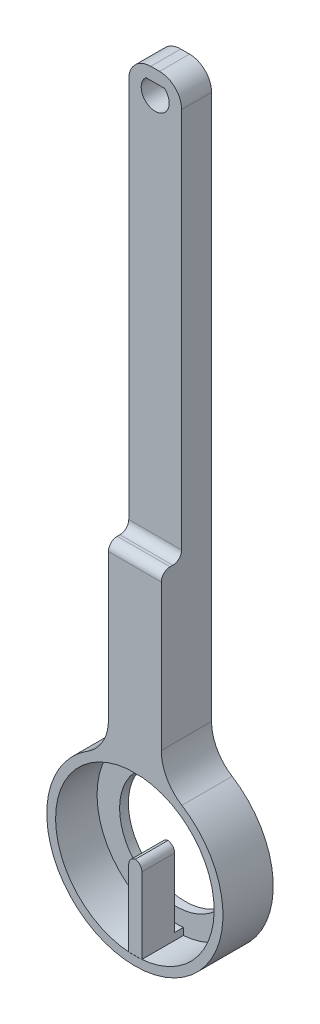
ISO-10303-21;
HEADER;
FILE_DESCRIPTION(('STEP AP214'),'2;1');
FILE_NAME('part.step','',(''),(''),'','','');
FILE_SCHEMA(('AUTOMOTIVE_DESIGN { 1 0 10303 214 1 1 1 1 }'));
ENDSEC;
DATA;
#1=APPLICATION_CONTEXT('core data for automotive mechanical design processes');
#2=APPLICATION_PROTOCOL_DEFINITION('international standard','automotive_design',2000,#1);
#3=PRODUCT_CONTEXT('',#1,'mechanical');
#4=PRODUCT('Part','Part','',(#3));
#5=PRODUCT_RELATED_PRODUCT_CATEGORY('part','',(#4));
#6=PRODUCT_DEFINITION_FORMATION('','',#4);
#7=PRODUCT_DEFINITION_CONTEXT('part definition',#1,'design');
#8=PRODUCT_DEFINITION('design','',#6,#7);
#9=PRODUCT_DEFINITION_SHAPE('','',#8);
#10=(LENGTH_UNIT() NAMED_UNIT(*) SI_UNIT(.MILLI.,.METRE.));
#11=(NAMED_UNIT(*) PLANE_ANGLE_UNIT() SI_UNIT($,.RADIAN.));
#12=(NAMED_UNIT(*) SI_UNIT($,.STERADIAN.) SOLID_ANGLE_UNIT());
#13=UNCERTAINTY_MEASURE_WITH_UNIT(LENGTH_MEASURE(1.E-05),#10,'distance_accuracy_value','');
#14=(GEOMETRIC_REPRESENTATION_CONTEXT(3) GLOBAL_UNCERTAINTY_ASSIGNED_CONTEXT((#13)) GLOBAL_UNIT_ASSIGNED_CONTEXT((#10,
#11,#12)) REPRESENTATION_CONTEXT('',''));
#15=CARTESIAN_POINT('',(0.,0.,0.));
#16=DIRECTION('',(0.,0.,1.));
#17=DIRECTION('',(1.,0.,0.));
#18=AXIS2_PLACEMENT_3D('',#15,#16,#17);
#19=CARTESIAN_POINT('',(0.359349427132485,-88.1961999037174,24.));
#20=DIRECTION('',(0.,0.,-1.));
#21=DIRECTION('',(-1.,0.,0.));
#22=AXIS2_PLACEMENT_3D('',#19,#20,#21);
#23=CYLINDRICAL_SURFACE('',#22,1.75);
#24=DIRECTION('',(0.,0.,-1.));
#25=VECTOR('',#24,1.);
#26=CARTESIAN_POINT('',(-1.39065057286751,-88.1961999037174,24.));
#27=LINE('',#26,#25);
#28=CARTESIAN_POINT('',(-1.39065057286751,-88.1961999037174,11.4140859188602));
#29=VERTEX_POINT('',#28);
#30=CARTESIAN_POINT('',(-1.39065057286751,-88.1961999037174,4.));
#31=VERTEX_POINT('',#30);
#32=EDGE_CURVE('E137',#29,#31,#27,.T.);
#33=ORIENTED_EDGE('',*,*,#32,.F.);
#34=CARTESIAN_POINT('',(0.359349427132485,-88.1961999037174,11.4140859188602));
#35=DIRECTION('',(0.,0.,1.));
#36=DIRECTION('',(0.,-1.,0.));
#37=AXIS2_PLACEMENT_3D('',#34,#35,#36);
#38=CIRCLE('',#37,1.75);
#39=CARTESIAN_POINT('',(0.109349427132485,-86.4641490961485,11.4140859188602));
#40=VERTEX_POINT('',#39);
#41=EDGE_CURVE('E130',#29,#40,#38,.F.);
#42=ORIENTED_EDGE('',*,*,#41,.T.);
#43=DIRECTION('',(0.,0.,-1.));
#44=VECTOR('',#43,1.);
#45=CARTESIAN_POINT('',(0.109349427132484,-86.4641490961485,13.));
#46=LINE('',#45,#44);
#47=CARTESIAN_POINT('',(0.109349427132484,-86.4641490961485,4.));
#48=VERTEX_POINT('',#47);
#49=EDGE_CURVE('E129',#48,#40,#46,.F.);
#50=ORIENTED_EDGE('',*,*,#49,.F.);
#51=CARTESIAN_POINT('',(0.359349427132485,-88.1961999037174,4.));
#52=DIRECTION('',(0.,0.,-1.));
#53=DIRECTION('',(-1.,0.,0.));
#54=AXIS2_PLACEMENT_3D('',#51,#52,#53);
#55=CIRCLE('',#54,1.75);
#56=EDGE_CURVE('E82',#48,#31,#55,.F.);
#57=ORIENTED_EDGE('',*,*,#56,.T.);
#58=EDGE_LOOP('',(#33,#42,#50,#57));
#59=FACE_BOUND('',#58,.T.);
#60=ADVANCED_FACE('F61',(#59),#23,.T.);
#61=CARTESIAN_POINT('',(-0.140650572867517,-88.1961999037174,24.));
#62=DIRECTION('',(0.,0.,-1.));
#63=DIRECTION('',(-1.,0.,0.));
#64=AXIS2_PLACEMENT_3D('',#61,#62,#63);
#65=CYLINDRICAL_SURFACE('',#64,1.75);
#66=ORIENTED_EDGE('',*,*,#49,.T.);
#67=CARTESIAN_POINT('',(-0.140650572867517,-88.1961999037174,11.4140859188602));
#68=DIRECTION('',(0.,0.,1.));
#69=DIRECTION('',(0.,-1.,0.));
#70=AXIS2_PLACEMENT_3D('',#67,#68,#69);
#71=CIRCLE('',#70,1.75);
#72=CARTESIAN_POINT('',(1.60934942713248,-88.1961999037174,11.4140859188602));
#73=VERTEX_POINT('',#72);
#74=EDGE_CURVE('E118',#40,#73,#71,.F.);
#75=ORIENTED_EDGE('',*,*,#74,.T.);
#76=DIRECTION('',(0.,0.,-1.));
#77=VECTOR('',#76,1.);
#78=CARTESIAN_POINT('',(1.60934942713248,-88.1961999037174,24.));
#79=LINE('',#78,#77);
#80=CARTESIAN_POINT('',(1.60934942713248,-88.1961999037174,4.));
#81=VERTEX_POINT('',#80);
#82=EDGE_CURVE('E127',#81,#73,#79,.F.);
#83=ORIENTED_EDGE('',*,*,#82,.F.);
#84=CARTESIAN_POINT('',(-0.140650572867517,-88.1961999037174,4.));
#85=DIRECTION('',(0.,0.,-1.));
#86=DIRECTION('',(-1.,0.,0.));
#87=AXIS2_PLACEMENT_3D('',#84,#85,#86);
#88=CIRCLE('',#87,1.75);
#89=EDGE_CURVE('E140',#81,#48,#88,.F.);
#90=ORIENTED_EDGE('',*,*,#89,.T.);
#91=EDGE_LOOP('',(#66,#75,#83,#90));
#92=FACE_BOUND('',#91,.T.);
#93=ADVANCED_FACE('F126',(#92),#65,.T.);
#94=CARTESIAN_POINT('',(-1.39065057286751,-105.446199903717,24.));
#95=DIRECTION('',(-1.,0.,0.));
#96=DIRECTION('',(0.,0.,1.));
#97=AXIS2_PLACEMENT_3D('',#94,#95,#96);
#98=PLANE('',#97);
#99=DIRECTION('',(0.,0.,-1.));
#100=VECTOR('',#99,1.);
#101=CARTESIAN_POINT('',(-1.39065057286751,-105.446199903717,24.));
#102=LINE('',#101,#100);
#103=CARTESIAN_POINT('',(-1.39065057286751,-105.446199903717,11.4140859188602));
#104=VERTEX_POINT('',#103);
#105=CARTESIAN_POINT('',(-1.39065057286751,-105.446199903717,2.));
#106=VERTEX_POINT('',#105);
#107=EDGE_CURVE('E138',#104,#106,#102,.T.);
#108=ORIENTED_EDGE('',*,*,#107,.F.);
#109=DIRECTION('',(0.,1.,0.));
#110=VECTOR('',#109,1.);
#111=CARTESIAN_POINT('',(-1.39065057286751,-105.446199903717,11.4140859188602));
#112=LINE('',#111,#110);
#113=EDGE_CURVE('E131',#104,#29,#112,.T.);
#114=ORIENTED_EDGE('',*,*,#113,.T.);
#115=ORIENTED_EDGE('',*,*,#32,.T.);
#116=DIRECTION('',(0.,-1.,0.));
#117=VECTOR('',#116,1.);
#118=CARTESIAN_POINT('',(-1.39065057286751,-105.446199903717,4.));
#119=LINE('',#118,#117);
#120=CARTESIAN_POINT('',(-1.39065057286751,-103.836744529305,4.));
#121=VERTEX_POINT('',#120);
#122=EDGE_CURVE('E165',#31,#121,#119,.T.);
#123=ORIENTED_EDGE('',*,*,#122,.T.);
#124=DIRECTION('',(0.,0.,-1.));
#125=VECTOR('',#124,1.);
#126=CARTESIAN_POINT('',(-1.39065057286751,-103.836744529305,4.));
#127=LINE('',#126,#125);
#128=CARTESIAN_POINT('',(-1.39065057286751,-103.836744529305,2.));
#129=VERTEX_POINT('',#128);
#130=EDGE_CURVE('E148',#129,#121,#127,.F.);
#131=ORIENTED_EDGE('',*,*,#130,.F.);
#132=DIRECTION('',(0.,1.,0.));
#133=VECTOR('',#132,1.);
#134=CARTESIAN_POINT('',(-1.39065057286751,-105.446199903717,2.));
#135=LINE('',#134,#133);
#136=EDGE_CURVE('E147',#106,#129,#135,.T.);
#137=ORIENTED_EDGE('',*,*,#136,.F.);
#138=EDGE_LOOP('',(#108,#114,#115,#123,#131,#137));
#139=FACE_BOUND('',#138,.T.);
#140=ADVANCED_FACE('F164',(#139),#98,.T.);
#141=CARTESIAN_POINT('',(-1.39065057286751,-105.446199903717,24.));
#142=DIRECTION('',(-0.00609617310807327,0.999981418164076,0.));
#143=DIRECTION('',(-0.999981418164076,-0.00609617310807327,0.));
#144=AXIS2_PLACEMENT_3D('',#141,#142,#143);
#145=PLANE('',#144);
#146=DIRECTION('',(0.999981418164076,0.00609617310807327,0.));
#147=VECTOR('',#146,1.);
#148=CARTESIAN_POINT('',(-1.39065057286751,-105.446199903717,11.4140859188602));
#149=LINE('',#148,#147);
#150=CARTESIAN_POINT('',(1.60934942713249,-105.427911044553,11.4140859188602));
#151=VERTEX_POINT('',#150);
#152=EDGE_CURVE('E75',#104,#151,#149,.T.);
#153=ORIENTED_EDGE('',*,*,#152,.F.);
#154=ORIENTED_EDGE('',*,*,#107,.T.);
#155=DIRECTION('',(0.999981418164076,0.00609617310807327,0.));
#156=VECTOR('',#155,1.);
#157=CARTESIAN_POINT('',(-1.39065057286751,-105.446199903717,2.));
#158=LINE('',#157,#156);
#159=CARTESIAN_POINT('',(1.60934942713249,-105.427911044553,2.));
#160=VERTEX_POINT('',#159);
#161=EDGE_CURVE('E170',#106,#160,#158,.T.);
#162=ORIENTED_EDGE('',*,*,#161,.T.);
#163=DIRECTION('',(0.,0.,-1.));
#164=VECTOR('',#163,1.);
#165=CARTESIAN_POINT('',(1.60934942713249,-105.427911044553,24.));
#166=LINE('',#165,#164);
#167=EDGE_CURVE('E142',#151,#160,#166,.T.);
#168=ORIENTED_EDGE('',*,*,#167,.F.);
#169=EDGE_LOOP('',(#153,#154,#162,#168));
#170=FACE_BOUND('',#169,.T.);
#171=ADVANCED_FACE('F177',(#170),#145,.F.);
#172=CARTESIAN_POINT('',(1.60934942713248,-86.4461999037174,24.));
#173=DIRECTION('',(1.,0.,0.));
#174=DIRECTION('',(0.,1.,0.));
#175=AXIS2_PLACEMENT_3D('',#172,#173,#174);
#176=PLANE('',#175);
#177=ORIENTED_EDGE('',*,*,#82,.T.);
#178=DIRECTION('',(0.,-1.,0.));
#179=VECTOR('',#178,1.);
#180=CARTESIAN_POINT('',(1.60934942713248,-86.4461999037174,11.4140859188602));
#181=LINE('',#180,#179);
#182=EDGE_CURVE('E12',#73,#151,#181,.T.);
#183=ORIENTED_EDGE('',*,*,#182,.T.);
#184=ORIENTED_EDGE('',*,*,#167,.T.);
#185=DIRECTION('',(0.,-1.,0.));
#186=VECTOR('',#185,1.);
#187=CARTESIAN_POINT('',(1.60934942713248,-86.4461999037174,2.));
#188=LINE('',#187,#186);
#189=CARTESIAN_POINT('',(1.60934942713249,-103.81665177826,2.));
#190=VERTEX_POINT('',#189);
#191=EDGE_CURVE('E171',#190,#160,#188,.T.);
#192=ORIENTED_EDGE('',*,*,#191,.F.);
#193=DIRECTION('',(0.,0.,-1.));
#194=VECTOR('',#193,1.);
#195=CARTESIAN_POINT('',(1.60934942713249,-103.81665177826,4.));
#196=LINE('',#195,#194);
#197=CARTESIAN_POINT('',(1.60934942713249,-103.81665177826,4.));
#198=VERTEX_POINT('',#197);
#199=EDGE_CURVE('E155',#198,#190,#196,.T.);
#200=ORIENTED_EDGE('',*,*,#199,.F.);
#201=DIRECTION('',(0.,1.,0.));
#202=VECTOR('',#201,1.);
#203=CARTESIAN_POINT('',(1.60934942713248,-86.4461999037174,4.));
#204=LINE('',#203,#202);
#205=EDGE_CURVE('E136',#198,#81,#204,.T.);
#206=ORIENTED_EDGE('',*,*,#205,.T.);
#207=EDGE_LOOP('',(#177,#183,#184,#192,#200,#206));
#208=FACE_BOUND('',#207,.T.);
#209=ADVANCED_FACE('F134',(#208),#176,.T.);
#210=CARTESIAN_POINT('',(0.,0.,2.));
#211=DIRECTION('',(0.,0.,-1.));
#212=DIRECTION('',(-1.,0.,0.));
#213=AXIS2_PLACEMENT_3D('',#210,#211,#212);
#214=PLANE('',#213);
#215=CARTESIAN_POINT('',(0.,-87.5,2.));
#216=DIRECTION('',(0.,0.,-1.));
#217=DIRECTION('',(-1.,0.,0.));
#218=AXIS2_PLACEMENT_3D('',#215,#216,#217);
#219=CIRCLE('',#218,16.3958266284931);
#220=EDGE_CURVE('E68',#190,#129,#219,.T.);
#221=ORIENTED_EDGE('',*,*,#220,.F.);
#222=ORIENTED_EDGE('',*,*,#191,.T.);
#223=ORIENTED_EDGE('',*,*,#161,.F.);
#224=ORIENTED_EDGE('',*,*,#136,.T.);
#225=EDGE_LOOP('',(#221,#222,#223,#224));
#226=FACE_BOUND('',#225,.T.);
#227=ADVANCED_FACE('F168',(#226),#214,.T.);
#228=CARTESIAN_POINT('',(0.,-87.5,4.));
#229=DIRECTION('',(0.,0.,-1.));
#230=DIRECTION('',(-1.,0.,0.));
#231=AXIS2_PLACEMENT_3D('',#228,#229,#230);
#232=CYLINDRICAL_SURFACE('',#231,16.3958266284931);
#233=ORIENTED_EDGE('',*,*,#130,.T.);
#234=CARTESIAN_POINT('',(0.,-87.5,4.));
#235=DIRECTION('',(0.,0.,-1.));
#236=DIRECTION('',(-1.,0.,0.));
#237=AXIS2_PLACEMENT_3D('',#234,#235,#236);
#238=CIRCLE('',#237,16.3958266284931);
#239=EDGE_CURVE('E183',#198,#121,#238,.T.);
#240=ORIENTED_EDGE('',*,*,#239,.F.);
#241=ORIENTED_EDGE('',*,*,#199,.T.);
#242=ORIENTED_EDGE('',*,*,#220,.T.);
#243=EDGE_LOOP('',(#233,#240,#241,#242));
#244=FACE_BOUND('',#243,.T.);
#245=ADVANCED_FACE('F152',(#244),#232,.F.);
#246=CARTESIAN_POINT('',(0.,-87.5,4.));
#247=DIRECTION('',(0.,0.,-1.));
#248=DIRECTION('',(-1.,0.,0.));
#249=AXIS2_PLACEMENT_3D('',#246,#247,#248);
#250=PLANE('',#249);
#251=ORIENTED_EDGE('',*,*,#56,.F.);
#252=ORIENTED_EDGE('',*,*,#89,.F.);
#253=ORIENTED_EDGE('',*,*,#205,.F.);
#254=ORIENTED_EDGE('',*,*,#239,.T.);
#255=ORIENTED_EDGE('',*,*,#122,.F.);
#256=EDGE_LOOP('',(#251,#252,#253,#254,#255));
#257=FACE_BOUND('',#256,.T.);
#258=ADVANCED_FACE('F189',(#257),#250,.T.);
#259=CARTESIAN_POINT('',(-35.,-27.0166279198616,11.4140859188601));
#260=DIRECTION('',(0.,0.,1.));
#261=DIRECTION('',(0.,-1.,0.));
#262=AXIS2_PLACEMENT_3D('',#259,#260,#261);
#263=PLANE('',#262);
#264=ORIENTED_EDGE('',*,*,#113,.F.);
#265=ORIENTED_EDGE('',*,*,#152,.T.);
#266=ORIENTED_EDGE('',*,*,#182,.F.);
#267=ORIENTED_EDGE('',*,*,#74,.F.);
#268=ORIENTED_EDGE('',*,*,#41,.F.);
#269=EDGE_LOOP('',(#264,#265,#266,#267,#268));
#270=FACE_BOUND('',#269,.T.);
#271=ADVANCED_FACE('F117',(#270),#263,.T.);
#272=CLOSED_SHELL('',(#60,#93,#140,#171,#209,#227,#245,#258,#271));
#273=MANIFOLD_SOLID_BREP('B2',#272);
#274=CARTESIAN_POINT('',(0.,-87.5,13.));
#275=DIRECTION('',(0.,0.,-1.));
#276=DIRECTION('',(-1.,0.,0.));
#277=AXIS2_PLACEMENT_3D('',#274,#275,#276);
#278=CYLINDRICAL_SURFACE('',#277,20.);
#279=CARTESIAN_POINT('',(0.,-87.5,11.4140859188602));
#280=DIRECTION('',(0.,0.,1.));
#281=DIRECTION('',(0.,-1.,0.));
#282=AXIS2_PLACEMENT_3D('',#279,#280,#281);
#283=CIRCLE('',#282,20.);
#284=CARTESIAN_POINT('',(-10.6666666666667,-70.581896612734,11.4140859188602));
#285=VERTEX_POINT('',#284);
#286=CARTESIAN_POINT('',(10.6666666666667,-70.581896612734,11.4140859188602));
#287=VERTEX_POINT('',#286);
#288=EDGE_CURVE('E499',#285,#287,#283,.T.);
#289=ORIENTED_EDGE('',*,*,#288,.F.);
#290=DIRECTION('',(0.,0.,-1.));
#291=VECTOR('',#290,1.);
#292=CARTESIAN_POINT('',(-10.6666666666667,-70.581896612734,13.));
#293=LINE('',#292,#291);
#294=CARTESIAN_POINT('',(-10.6666666666667,-70.581896612734,0.));
#295=VERTEX_POINT('',#294);
#296=EDGE_CURVE('E481',#285,#295,#293,.T.);
#297=ORIENTED_EDGE('',*,*,#296,.T.);
#298=CARTESIAN_POINT('',(0.,-87.5,0.));
#299=DIRECTION('',(0.,0.,1.));
#300=DIRECTION('',(1.,0.,0.));
#301=AXIS2_PLACEMENT_3D('',#298,#299,#300);
#302=CIRCLE('',#301,20.);
#303=CARTESIAN_POINT('',(10.6666666666667,-70.581896612734,0.));
#304=VERTEX_POINT('',#303);
#305=EDGE_CURVE('E417',#295,#304,#302,.T.);
#306=ORIENTED_EDGE('',*,*,#305,.T.);
#307=DIRECTION('',(0.,0.,-1.));
#308=VECTOR('',#307,1.);
#309=CARTESIAN_POINT('',(10.6666666666667,-70.581896612734,13.));
#310=LINE('',#309,#308);
#311=EDGE_CURVE('E477',#304,#287,#310,.F.);
#312=ORIENTED_EDGE('',*,*,#311,.T.);
#313=EDGE_LOOP('',(#289,#297,#306,#312));
#314=FACE_BOUND('',#313,.T.);
#315=ADVANCED_FACE('F263',(#314),#278,.T.);
#316=CARTESIAN_POINT('',(0.,-87.5000000000001,2.));
#317=DIRECTION('',(0.,0.,1.));
#318=DIRECTION('',(1.,0.,0.));
#319=AXIS2_PLACEMENT_3D('',#316,#317,#318);
#320=CYLINDRICAL_SURFACE('',#319,18.);
#321=CARTESIAN_POINT('',(0.,-87.5000000000001,11.4140859188602));
#322=DIRECTION('',(0.,0.,1.));
#323=DIRECTION('',(0.,-1.,0.));
#324=AXIS2_PLACEMENT_3D('',#321,#322,#323);
#325=CIRCLE('',#324,18.);
#326=CARTESIAN_POINT('',(1.78406217918483,-69.5886314833065,11.4140859188602));
#327=VERTEX_POINT('',#326);
#328=CARTESIAN_POINT('',(-1.78406217918483,-69.5886314833065,11.4140859188602));
#329=VERTEX_POINT('',#328);
#330=EDGE_CURVE('E379',#327,#329,#325,.F.);
#331=ORIENTED_EDGE('',*,*,#330,.F.);
#332=DIRECTION('',(0.,0.,1.));
#333=VECTOR('',#332,1.);
#334=CARTESIAN_POINT('',(1.78406217918483,-69.5886314833065,2.));
#335=LINE('',#334,#333);
#336=CARTESIAN_POINT('',(1.78406217918483,-69.5886314833065,2.));
#337=VERTEX_POINT('',#336);
#338=EDGE_CURVE('E390',#327,#337,#335,.F.);
#339=ORIENTED_EDGE('',*,*,#338,.T.);
#340=CARTESIAN_POINT('',(0.,-87.5000000000001,2.));
#341=DIRECTION('',(0.,0.,1.));
#342=DIRECTION('',(1.,0.,0.));
#343=AXIS2_PLACEMENT_3D('',#340,#341,#342);
#344=CIRCLE('',#343,18.);
#345=CARTESIAN_POINT('',(-1.78406217918483,-69.5886314833065,2.));
#346=VERTEX_POINT('',#345);
#347=EDGE_CURVE('E413',#346,#337,#344,.T.);
#348=ORIENTED_EDGE('',*,*,#347,.F.);
#349=DIRECTION('',(0.,0.,1.));
#350=VECTOR('',#349,1.);
#351=CARTESIAN_POINT('',(-1.78406217918483,-69.5886314833065,2.));
#352=LINE('',#351,#350);
#353=EDGE_CURVE('E392',#346,#329,#352,.T.);
#354=ORIENTED_EDGE('',*,*,#353,.T.);
#355=EDGE_LOOP('',(#331,#339,#348,#354));
#356=FACE_BOUND('',#355,.T.);
#357=ADVANCED_FACE('F388',(#356),#320,.F.);
#358=CARTESIAN_POINT('',(5.99999999999998,-69.5886314833065,15.8));
#359=DIRECTION('',(0.,-1.,0.));
#360=DIRECTION('',(0.,0.,-1.));
#361=AXIS2_PLACEMENT_3D('',#358,#359,#360);
#362=PLANE('',#361);
#363=ORIENTED_EDGE('',*,*,#338,.F.);
#364=DIRECTION('',(-1.,0.,0.));
#365=VECTOR('',#364,1.);
#366=CARTESIAN_POINT('',(5.99999999999998,-69.5886314833065,11.4140859188602));
#367=LINE('',#366,#365);
#368=EDGE_CURVE('E376',#327,#329,#367,.T.);
#369=ORIENTED_EDGE('',*,*,#368,.T.);
#370=ORIENTED_EDGE('',*,*,#353,.F.);
#371=DIRECTION('',(1.,0.,0.));
#372=VECTOR('',#371,1.);
#373=CARTESIAN_POINT('',(0.,-69.5886314833065,2.));
#374=LINE('',#373,#372);
#375=EDGE_CURVE('E398',#346,#337,#374,.T.);
#376=ORIENTED_EDGE('',*,*,#375,.T.);
#377=EDGE_LOOP('',(#363,#369,#370,#376));
#378=FACE_BOUND('',#377,.T.);
#379=ADVANCED_FACE('F397',(#378),#362,.T.);
#380=CARTESIAN_POINT('',(5.99999999999998,-69.5886314833065,15.8));
#381=DIRECTION('',(1.,0.,0.));
#382=DIRECTION('',(0.,0.,-1.));
#383=AXIS2_PLACEMENT_3D('',#380,#381,#382);
#384=PLANE('',#383);
#385=DIRECTION('',(0.,-1.,0.));
#386=VECTOR('',#385,1.);
#387=CARTESIAN_POINT('',(5.99999999999998,-69.5886314833065,11.4140859188602));
#388=LINE('',#387,#386);
#389=CARTESIAN_POINT('',(5.99999999999998,-29.0166279198616,11.4140859188601));
#390=VERTEX_POINT('',#389);
#391=CARTESIAN_POINT('',(5.99999999999998,-62.1228449191009,11.4140859188601));
#392=VERTEX_POINT('',#391);
#393=EDGE_CURVE('E385',#390,#392,#388,.T.);
#394=ORIENTED_EDGE('',*,*,#393,.T.);
#395=DIRECTION('',(0.,0.,-1.));
#396=VECTOR('',#395,1.);
#397=CARTESIAN_POINT('',(5.99999999999998,-62.1228449191009,15.8));
#398=LINE('',#397,#396);
#399=CARTESIAN_POINT('',(5.99999999999998,-62.1228449191009,0.));
#400=VERTEX_POINT('',#399);
#401=EDGE_CURVE('E279',#392,#400,#398,.T.);
#402=ORIENTED_EDGE('',*,*,#401,.T.);
#403=DIRECTION('',(0.,-1.,0.));
#404=VECTOR('',#403,1.);
#405=CARTESIAN_POINT('',(5.99999999999998,-69.5886314833065,0.));
#406=LINE('',#405,#404);
#407=CARTESIAN_POINT('',(5.99999999999998,61.5832427245863,0.));
#408=VERTEX_POINT('',#407);
#409=EDGE_CURVE('E522',#408,#400,#406,.T.);
#410=ORIENTED_EDGE('',*,*,#409,.F.);
#411=DIRECTION('',(0.,0.,-1.));
#412=VECTOR('',#411,1.);
#413=CARTESIAN_POINT('',(5.99999999999998,61.5832427245863,15.8));
#414=LINE('',#413,#412);
#415=CARTESIAN_POINT('',(5.99999999999998,61.5832427245863,6.79999999999999));
#416=VERTEX_POINT('',#415);
#417=EDGE_CURVE('E436',#408,#416,#414,.F.);
#418=ORIENTED_EDGE('',*,*,#417,.T.);
#419=DIRECTION('',(0.,-1.,0.));
#420=VECTOR('',#419,1.);
#421=CARTESIAN_POINT('',(5.99999999999998,-27.0166279198616,6.79999999999999));
#422=LINE('',#421,#420);
#423=CARTESIAN_POINT('',(5.99999999999998,-25.0166279198616,6.79999999999999));
#424=VERTEX_POINT('',#423);
#425=EDGE_CURVE('E553',#416,#424,#422,.T.);
#426=ORIENTED_EDGE('',*,*,#425,.T.);
#427=CARTESIAN_POINT('',(5.99999999999998,-25.0166279198616,8.79999999999999));
#428=DIRECTION('',(1.,0.,0.));
#429=DIRECTION('',(0.,0.,-1.));
#430=AXIS2_PLACEMENT_3D('',#427,#428,#429);
#431=CIRCLE('',#430,2.);
#432=CARTESIAN_POINT('',(5.99999999999998,-27.0166279198616,8.79999999999999));
#433=VERTEX_POINT('',#432);
#434=EDGE_CURVE('E474',#424,#433,#431,.F.);
#435=ORIENTED_EDGE('',*,*,#434,.T.);
#436=DIRECTION('',(0.,0.,-1.));
#437=VECTOR('',#436,1.);
#438=CARTESIAN_POINT('',(5.99999999999998,-27.0166279198616,15.8));
#439=LINE('',#438,#437);
#440=CARTESIAN_POINT('',(5.99999999999998,-27.0166279198616,9.41408591886015));
#441=VERTEX_POINT('',#440);
#442=EDGE_CURVE('E407',#441,#433,#439,.T.);
#443=ORIENTED_EDGE('',*,*,#442,.F.);
#444=CARTESIAN_POINT('',(5.99999999999998,-29.0166279198616,9.41408591886015));
#445=DIRECTION('',(1.,0.,0.));
#446=DIRECTION('',(0.,0.,-1.));
#447=AXIS2_PLACEMENT_3D('',#444,#445,#446);
#448=CIRCLE('',#447,2.);
#449=EDGE_CURVE('E461',#441,#390,#448,.T.);
#450=ORIENTED_EDGE('',*,*,#449,.T.);
#451=EDGE_LOOP('',(#394,#402,#410,#418,#426,#435,#443,#450));
#452=FACE_BOUND('',#451,.T.);
#453=ADVANCED_FACE('F594',(#452),#384,.T.);
#454=CARTESIAN_POINT('',(-6.00000000000002,-69.5886314833065,15.8));
#455=DIRECTION('',(-1.,0.,0.));
#456=DIRECTION('',(0.,0.,1.));
#457=AXIS2_PLACEMENT_3D('',#454,#455,#456);
#458=PLANE('',#457);
#459=DIRECTION('',(0.,1.,0.));
#460=VECTOR('',#459,1.);
#461=CARTESIAN_POINT('',(-6.00000000000002,-69.5886314833065,0.));
#462=LINE('',#461,#460);
#463=CARTESIAN_POINT('',(-6.00000000000002,-62.122844919101,0.));
#464=VERTEX_POINT('',#463);
#465=CARTESIAN_POINT('',(-6.00000000000002,61.5832427245863,0.));
#466=VERTEX_POINT('',#465);
#467=EDGE_CURVE('E515',#464,#466,#462,.T.);
#468=ORIENTED_EDGE('',*,*,#467,.F.);
#469=DIRECTION('',(0.,0.,-1.));
#470=VECTOR('',#469,1.);
#471=CARTESIAN_POINT('',(-6.00000000000002,-62.122844919101,15.8));
#472=LINE('',#471,#470);
#473=CARTESIAN_POINT('',(-6.00000000000002,-62.122844919101,11.4140859188601));
#474=VERTEX_POINT('',#473);
#475=EDGE_CURVE('E485',#464,#474,#472,.F.);
#476=ORIENTED_EDGE('',*,*,#475,.T.);
#477=DIRECTION('',(0.,1.,0.));
#478=VECTOR('',#477,1.);
#479=CARTESIAN_POINT('',(-6.00000000000002,-69.5886314833065,11.4140859188602));
#480=LINE('',#479,#478);
#481=CARTESIAN_POINT('',(-6.00000000000002,-29.0166279198616,11.4140859188601));
#482=VERTEX_POINT('',#481);
#483=EDGE_CURVE('E500',#474,#482,#480,.T.);
#484=ORIENTED_EDGE('',*,*,#483,.T.);
#485=CARTESIAN_POINT('',(-6.00000000000002,-29.0166279198616,9.41408591886015));
#486=DIRECTION('',(-1.,0.,0.));
#487=DIRECTION('',(0.,0.,1.));
#488=AXIS2_PLACEMENT_3D('',#485,#486,#487);
#489=CIRCLE('',#488,2.);
#490=CARTESIAN_POINT('',(-6.00000000000002,-27.0166279198616,9.41408591886015));
#491=VERTEX_POINT('',#490);
#492=EDGE_CURVE('E468',#482,#491,#489,.T.);
#493=ORIENTED_EDGE('',*,*,#492,.T.);
#494=DIRECTION('',(0.,0.,-1.));
#495=VECTOR('',#494,1.);
#496=CARTESIAN_POINT('',(-6.00000000000002,-27.0166279198616,15.8));
#497=LINE('',#496,#495);
#498=CARTESIAN_POINT('',(-6.00000000000002,-27.0166279198616,8.79999999999999));
#499=VERTEX_POINT('',#498);
#500=EDGE_CURVE('E521',#491,#499,#497,.T.);
#501=ORIENTED_EDGE('',*,*,#500,.T.);
#502=CARTESIAN_POINT('',(-6.00000000000002,-25.0166279198616,8.79999999999999));
#503=DIRECTION('',(-1.,0.,0.));
#504=DIRECTION('',(0.,0.,1.));
#505=AXIS2_PLACEMENT_3D('',#502,#503,#504);
#506=CIRCLE('',#505,2.);
#507=CARTESIAN_POINT('',(-6.00000000000002,-25.0166279198616,6.79999999999999));
#508=VERTEX_POINT('',#507);
#509=EDGE_CURVE('E471',#499,#508,#506,.F.);
#510=ORIENTED_EDGE('',*,*,#509,.T.);
#511=DIRECTION('',(0.,1.,0.));
#512=VECTOR('',#511,1.);
#513=CARTESIAN_POINT('',(-6.00000000000002,-27.0166279198616,6.79999999999999));
#514=LINE('',#513,#512);
#515=CARTESIAN_POINT('',(-6.00000000000002,61.5832427245863,6.79999999999999));
#516=VERTEX_POINT('',#515);
#517=EDGE_CURVE('E544',#508,#516,#514,.T.);
#518=ORIENTED_EDGE('',*,*,#517,.T.);
#519=DIRECTION('',(0.,0.,-1.));
#520=VECTOR('',#519,1.);
#521=CARTESIAN_POINT('',(-6.00000000000002,61.5832427245863,15.8));
#522=LINE('',#521,#520);
#523=EDGE_CURVE('E446',#516,#466,#522,.T.);
#524=ORIENTED_EDGE('',*,*,#523,.T.);
#525=EDGE_LOOP('',(#468,#476,#484,#493,#501,#510,#518,#524));
#526=FACE_BOUND('',#525,.T.);
#527=ADVANCED_FACE('F518',(#526),#458,.T.);
#528=CARTESIAN_POINT('',(5.99999999999998,-27.0166279198616,15.8));
#529=DIRECTION('',(0.,1.,0.));
#530=DIRECTION('',(0.,0.,1.));
#531=AXIS2_PLACEMENT_3D('',#528,#529,#530);
#532=PLANE('',#531);
#533=ORIENTED_EDGE('',*,*,#442,.T.);
#534=DIRECTION('',(-1.,0.,0.));
#535=VECTOR('',#534,1.);
#536=CARTESIAN_POINT('',(-6.00000000000002,-27.0166279198616,8.79999999999999));
#537=LINE('',#536,#535);
#538=EDGE_CURVE('E454',#433,#499,#537,.T.);
#539=ORIENTED_EDGE('',*,*,#538,.T.);
#540=ORIENTED_EDGE('',*,*,#500,.F.);
#541=DIRECTION('',(1.,0.,0.));
#542=VECTOR('',#541,1.);
#543=CARTESIAN_POINT('',(5.99999999999998,-27.0166279198616,9.41408591886015));
#544=LINE('',#543,#542);
#545=EDGE_CURVE('E450',#491,#441,#544,.T.);
#546=ORIENTED_EDGE('',*,*,#545,.T.);
#547=EDGE_LOOP('',(#533,#539,#540,#546));
#548=FACE_BOUND('',#547,.T.);
#549=ADVANCED_FACE('F536',(#548),#532,.T.);
#550=CARTESIAN_POINT('',(0.,0.,0.));
#551=DIRECTION('',(0.,0.,1.));
#552=DIRECTION('',(1.,0.,0.));
#553=AXIS2_PLACEMENT_3D('',#550,#551,#552);
#554=PLANE('',#553);
#555=DIRECTION('',(1.,0.,0.));
#556=VECTOR('',#555,1.);
#557=CARTESIAN_POINT('',(5.99999999999998,66.5832427245863,0.));
#558=LINE('',#557,#556);
#559=CARTESIAN_POINT('',(-1.00000000000002,66.5832427245863,0.));
#560=VERTEX_POINT('',#559);
#561=CARTESIAN_POINT('',(0.999999999999984,66.5832427245863,0.));
#562=VERTEX_POINT('',#561);
#563=EDGE_CURVE('E559',#560,#562,#558,.T.);
#564=ORIENTED_EDGE('',*,*,#563,.T.);
#565=CARTESIAN_POINT('',(0.999999999999984,61.5832427245863,0.));
#566=DIRECTION('',(0.,0.,1.));
#567=DIRECTION('',(1.,0.,0.));
#568=AXIS2_PLACEMENT_3D('',#565,#566,#567);
#569=CIRCLE('',#568,5.);
#570=EDGE_CURVE('E433',#562,#408,#569,.F.);
#571=ORIENTED_EDGE('',*,*,#570,.T.);
#572=ORIENTED_EDGE('',*,*,#409,.T.);
#573=CARTESIAN_POINT('',(16.,-62.1228449191009,0.));
#574=DIRECTION('',(0.,0.,1.));
#575=DIRECTION('',(1.,0.,0.));
#576=AXIS2_PLACEMENT_3D('',#573,#574,#575);
#577=CIRCLE('',#576,10.);
#578=EDGE_CURVE('E59',#400,#304,#577,.T.);
#579=ORIENTED_EDGE('',*,*,#578,.T.);
#580=ORIENTED_EDGE('',*,*,#305,.F.);
#581=CARTESIAN_POINT('',(-16.,-62.122844919101,0.));
#582=DIRECTION('',(0.,0.,1.));
#583=DIRECTION('',(1.,0.,0.));
#584=AXIS2_PLACEMENT_3D('',#581,#582,#583);
#585=CIRCLE('',#584,10.);
#586=EDGE_CURVE('E490',#295,#464,#585,.T.);
#587=ORIENTED_EDGE('',*,*,#586,.T.);
#588=ORIENTED_EDGE('',*,*,#467,.T.);
#589=CARTESIAN_POINT('',(-1.00000000000002,61.5832427245863,0.));
#590=DIRECTION('',(0.,0.,1.));
#591=DIRECTION('',(1.,0.,0.));
#592=AXIS2_PLACEMENT_3D('',#589,#590,#591);
#593=CIRCLE('',#592,5.);
#594=EDGE_CURVE('E430',#466,#560,#593,.F.);
#595=ORIENTED_EDGE('',*,*,#594,.T.);
#596=EDGE_LOOP('',(#564,#571,#572,#579,#580,#587,#588,#595));
#597=FACE_BOUND('',#596,.T.);
#598=CARTESIAN_POINT('',(0.,-87.6285008033563,0.));
#599=DIRECTION('',(0.,0.,-1.));
#600=DIRECTION('',(1.,0.,0.));
#601=AXIS2_PLACEMENT_3D('',#598,#599,#600);
#602=CIRCLE('',#601,12.8844015446727);
#603=CARTESIAN_POINT('',(12.8844015446727,-87.6285008033563,0.));
#604=VERTEX_POINT('',#603);
#605=EDGE_CURVE('E400',#604,#604,#602,.T.);
#606=ORIENTED_EDGE('',*,*,#605,.F.);
#607=EDGE_LOOP('',(#606));
#608=FACE_BOUND('',#607,.T.);
#609=DIRECTION('',(-1.,0.,0.));
#610=VECTOR('',#609,1.);
#611=CARTESIAN_POINT('',(-2.09926937004762,63.8029720718972,0.));
#612=LINE('',#611,#610);
#613=CARTESIAN_POINT('',(2.09926937004763,63.8029720718972,0.));
#614=VERTEX_POINT('',#613);
#615=CARTESIAN_POINT('',(-2.09926937004762,63.8029720718972,0.));
#616=VERTEX_POINT('',#615);
#617=EDGE_CURVE('E573',#614,#616,#612,.T.);
#618=ORIENTED_EDGE('',*,*,#617,.T.);
#619=CARTESIAN_POINT('',(0.,61.4178694694975,0.));
#620=DIRECTION('',(0.,0.,1.));
#621=DIRECTION('',(1.,0.,0.));
#622=AXIS2_PLACEMENT_3D('',#619,#620,#621);
#623=CIRCLE('',#622,3.17736468035916);
#624=EDGE_CURVE('E578',#616,#614,#623,.T.);
#625=ORIENTED_EDGE('',*,*,#624,.T.);
#626=EDGE_LOOP('',(#618,#625));
#627=FACE_BOUND('',#626,.T.);
#628=ADVANCED_FACE('F513',(#597,#608,#627),#554,.F.);
#629=CARTESIAN_POINT('',(0.,-87.5000000000001,2.));
#630=DIRECTION('',(0.,0.,1.));
#631=DIRECTION('',(1.,0.,0.));
#632=AXIS2_PLACEMENT_3D('',#629,#630,#631);
#633=PLANE('',#632);
#634=ORIENTED_EDGE('',*,*,#375,.F.);
#635=ORIENTED_EDGE('',*,*,#347,.T.);
#636=EDGE_LOOP('',(#634,#635));
#637=FACE_BOUND('',#636,.T.);
#638=CARTESIAN_POINT('',(0.,-87.6285008033563,2.));
#639=DIRECTION('',(0.,0.,-1.));
#640=DIRECTION('',(-1.,0.,0.));
#641=AXIS2_PLACEMENT_3D('',#638,#639,#640);
#642=CIRCLE('',#641,12.8844015446727);
#643=CARTESIAN_POINT('',(-12.8844015446727,-87.6285008033563,2.));
#644=VERTEX_POINT('',#643);
#645=EDGE_CURVE('E405',#644,#644,#642,.T.);
#646=ORIENTED_EDGE('',*,*,#645,.T.);
#647=EDGE_LOOP('',(#646));
#648=FACE_BOUND('',#647,.T.);
#649=ADVANCED_FACE('F628',(#637,#648),#633,.T.);
#650=CARTESIAN_POINT('',(0.,-87.6285008033563,2.));
#651=DIRECTION('',(0.,0.,-1.));
#652=DIRECTION('',(-1.,0.,0.));
#653=AXIS2_PLACEMENT_3D('',#650,#651,#652);
#654=CYLINDRICAL_SURFACE('',#653,12.8844015446727);
#655=ORIENTED_EDGE('',*,*,#605,.T.);
#656=EDGE_LOOP('',(#655));
#657=FACE_BOUND('',#656,.T.);
#658=ORIENTED_EDGE('',*,*,#645,.F.);
#659=EDGE_LOOP('',(#658));
#660=FACE_BOUND('',#659,.T.);
#661=ADVANCED_FACE('F632',(#657,#660),#654,.F.);
#662=CARTESIAN_POINT('',(5.99999999999998,66.5832427245863,6.79999999999999));
#663=DIRECTION('',(0.,1.,0.));
#664=DIRECTION('',(0.,0.,1.));
#665=AXIS2_PLACEMENT_3D('',#662,#663,#664);
#666=PLANE('',#665);
#667=DIRECTION('',(1.,0.,0.));
#668=VECTOR('',#667,1.);
#669=CARTESIAN_POINT('',(5.99999999999998,66.5832427245863,6.79999999999999));
#670=LINE('',#669,#668);
#671=CARTESIAN_POINT('',(-1.00000000000002,66.5832427245863,6.79999999999999));
#672=VERTEX_POINT('',#671);
#673=CARTESIAN_POINT('',(0.999999999999984,66.5832427245863,6.79999999999999));
#674=VERTEX_POINT('',#673);
#675=EDGE_CURVE('E527',#672,#674,#670,.T.);
#676=ORIENTED_EDGE('',*,*,#675,.T.);
#677=DIRECTION('',(0.,0.,-1.));
#678=VECTOR('',#677,1.);
#679=CARTESIAN_POINT('',(0.999999999999984,66.5832427245863,6.79999999999999));
#680=LINE('',#679,#678);
#681=EDGE_CURVE('E426',#674,#562,#680,.T.);
#682=ORIENTED_EDGE('',*,*,#681,.T.);
#683=ORIENTED_EDGE('',*,*,#563,.F.);
#684=DIRECTION('',(0.,0.,-1.));
#685=VECTOR('',#684,1.);
#686=CARTESIAN_POINT('',(-1.00000000000002,66.5832427245863,6.79999999999999));
#687=LINE('',#686,#685);
#688=EDGE_CURVE('E423',#560,#672,#687,.F.);
#689=ORIENTED_EDGE('',*,*,#688,.T.);
#690=EDGE_LOOP('',(#676,#682,#683,#689));
#691=FACE_BOUND('',#690,.T.);
#692=ADVANCED_FACE('F603',(#691),#666,.T.);
#693=CARTESIAN_POINT('',(0.,0.,6.79999999999999));
#694=DIRECTION('',(0.,0.,1.));
#695=DIRECTION('',(1.,0.,0.));
#696=AXIS2_PLACEMENT_3D('',#693,#694,#695);
#697=PLANE('',#696);
#698=ORIENTED_EDGE('',*,*,#517,.F.);
#699=DIRECTION('',(-1.,0.,0.));
#700=VECTOR('',#699,1.);
#701=CARTESIAN_POINT('',(5.99999999999998,-25.0166279198616,6.79999999999999));
#702=LINE('',#701,#700);
#703=EDGE_CURVE('E458',#508,#424,#702,.F.);
#704=ORIENTED_EDGE('',*,*,#703,.T.);
#705=ORIENTED_EDGE('',*,*,#425,.F.);
#706=CARTESIAN_POINT('',(0.999999999999984,61.5832427245863,6.79999999999999));
#707=DIRECTION('',(0.,0.,1.));
#708=DIRECTION('',(1.,0.,0.));
#709=AXIS2_PLACEMENT_3D('',#706,#707,#708);
#710=CIRCLE('',#709,5.);
#711=EDGE_CURVE('E443',#416,#674,#710,.T.);
#712=ORIENTED_EDGE('',*,*,#711,.T.);
#713=ORIENTED_EDGE('',*,*,#675,.F.);
#714=CARTESIAN_POINT('',(-1.00000000000002,61.5832427245863,6.79999999999999));
#715=DIRECTION('',(0.,0.,1.));
#716=DIRECTION('',(1.,0.,0.));
#717=AXIS2_PLACEMENT_3D('',#714,#715,#716);
#718=CIRCLE('',#717,5.);
#719=EDGE_CURVE('E439',#672,#516,#718,.T.);
#720=ORIENTED_EDGE('',*,*,#719,.T.);
#721=EDGE_LOOP('',(#698,#704,#705,#712,#713,#720));
#722=FACE_BOUND('',#721,.T.);
#723=CARTESIAN_POINT('',(0.,61.4178694694975,6.79999999999999));
#724=DIRECTION('',(0.,0.,1.));
#725=DIRECTION('',(1.,0.,0.));
#726=AXIS2_PLACEMENT_3D('',#723,#724,#725);
#727=CIRCLE('',#726,3.17736468035916);
#728=CARTESIAN_POINT('',(-2.09926937004762,63.8029720718972,6.79999999999999));
#729=VERTEX_POINT('',#728);
#730=CARTESIAN_POINT('',(2.09926937004763,63.8029720718972,6.79999999999999));
#731=VERTEX_POINT('',#730);
#732=EDGE_CURVE('E394',#729,#731,#727,.T.);
#733=ORIENTED_EDGE('',*,*,#732,.F.);
#734=DIRECTION('',(-1.,0.,0.));
#735=VECTOR('',#734,1.);
#736=CARTESIAN_POINT('',(-2.09926937004762,63.8029720718972,6.79999999999999));
#737=LINE('',#736,#735);
#738=EDGE_CURVE('E575',#731,#729,#737,.T.);
#739=ORIENTED_EDGE('',*,*,#738,.F.);
#740=EDGE_LOOP('',(#733,#739));
#741=FACE_BOUND('',#740,.T.);
#742=ADVANCED_FACE('F546',(#722,#741),#697,.T.);
#743=CARTESIAN_POINT('',(0.999999999999984,61.5832427245863,6.79999999999999));
#744=DIRECTION('',(0.,0.,-1.));
#745=DIRECTION('',(-1.,0.,0.));
#746=AXIS2_PLACEMENT_3D('',#743,#744,#745);
#747=CYLINDRICAL_SURFACE('',#746,5.);
#748=ORIENTED_EDGE('',*,*,#711,.F.);
#749=ORIENTED_EDGE('',*,*,#417,.F.);
#750=ORIENTED_EDGE('',*,*,#570,.F.);
#751=ORIENTED_EDGE('',*,*,#681,.F.);
#752=EDGE_LOOP('',(#748,#749,#750,#751));
#753=FACE_BOUND('',#752,.T.);
#754=ADVANCED_FACE('F600',(#753),#747,.T.);
#755=CARTESIAN_POINT('',(-1.00000000000002,61.5832427245863,15.8));
#756=DIRECTION('',(0.,0.,-1.));
#757=DIRECTION('',(-1.,0.,0.));
#758=AXIS2_PLACEMENT_3D('',#755,#756,#757);
#759=CYLINDRICAL_SURFACE('',#758,5.);
#760=ORIENTED_EDGE('',*,*,#719,.F.);
#761=ORIENTED_EDGE('',*,*,#688,.F.);
#762=ORIENTED_EDGE('',*,*,#594,.F.);
#763=ORIENTED_EDGE('',*,*,#523,.F.);
#764=EDGE_LOOP('',(#760,#761,#762,#763));
#765=FACE_BOUND('',#764,.T.);
#766=ADVANCED_FACE('F606',(#765),#759,.T.);
#767=CARTESIAN_POINT('',(0.,61.4178694694975,0.));
#768=DIRECTION('',(0.,0.,1.));
#769=DIRECTION('',(1.,0.,0.));
#770=AXIS2_PLACEMENT_3D('',#767,#768,#769);
#771=CYLINDRICAL_SURFACE('',#770,3.17736468035916);
#772=ORIENTED_EDGE('',*,*,#732,.T.);
#773=DIRECTION('',(0.,0.,1.));
#774=VECTOR('',#773,1.);
#775=CARTESIAN_POINT('',(2.09926937004763,63.8029720718972,0.));
#776=LINE('',#775,#774);
#777=EDGE_CURVE('E566',#614,#731,#776,.T.);
#778=ORIENTED_EDGE('',*,*,#777,.F.);
#779=ORIENTED_EDGE('',*,*,#624,.F.);
#780=DIRECTION('',(0.,0.,1.));
#781=VECTOR('',#780,1.);
#782=CARTESIAN_POINT('',(-2.09926937004762,63.8029720718972,0.));
#783=LINE('',#782,#781);
#784=EDGE_CURVE('E563',#616,#729,#783,.T.);
#785=ORIENTED_EDGE('',*,*,#784,.T.);
#786=EDGE_LOOP('',(#772,#778,#779,#785));
#787=FACE_BOUND('',#786,.T.);
#788=ADVANCED_FACE('F608',(#787),#771,.F.);
#789=CARTESIAN_POINT('',(-2.09926937004762,63.8029720718972,0.));
#790=DIRECTION('',(0.,1.,0.));
#791=DIRECTION('',(0.,0.,1.));
#792=AXIS2_PLACEMENT_3D('',#789,#790,#791);
#793=PLANE('',#792);
#794=ORIENTED_EDGE('',*,*,#738,.T.);
#795=ORIENTED_EDGE('',*,*,#784,.F.);
#796=ORIENTED_EDGE('',*,*,#617,.F.);
#797=ORIENTED_EDGE('',*,*,#777,.T.);
#798=EDGE_LOOP('',(#794,#795,#796,#797));
#799=FACE_BOUND('',#798,.T.);
#800=ADVANCED_FACE('F614',(#799),#793,.F.);
#801=CARTESIAN_POINT('',(-35.,-27.0166279198616,11.4140859188601));
#802=DIRECTION('',(0.,0.,1.));
#803=DIRECTION('',(0.,-1.,0.));
#804=AXIS2_PLACEMENT_3D('',#801,#802,#803);
#805=PLANE('',#804);
#806=ORIENTED_EDGE('',*,*,#393,.F.);
#807=DIRECTION('',(1.,0.,0.));
#808=VECTOR('',#807,1.);
#809=CARTESIAN_POINT('',(-35.,-29.0166279198616,11.4140859188601));
#810=LINE('',#809,#808);
#811=EDGE_CURVE('E464',#390,#482,#810,.F.);
#812=ORIENTED_EDGE('',*,*,#811,.T.);
#813=ORIENTED_EDGE('',*,*,#483,.F.);
#814=CARTESIAN_POINT('',(-16.,-62.122844919101,11.4140859188602));
#815=DIRECTION('',(0.,0.,1.));
#816=DIRECTION('',(0.,-1.,0.));
#817=AXIS2_PLACEMENT_3D('',#814,#815,#816);
#818=CIRCLE('',#817,10.);
#819=EDGE_CURVE('E493',#474,#285,#818,.F.);
#820=ORIENTED_EDGE('',*,*,#819,.T.);
#821=ORIENTED_EDGE('',*,*,#288,.T.);
#822=CARTESIAN_POINT('',(16.,-62.1228449191009,11.4140859188602));
#823=DIRECTION('',(0.,0.,1.));
#824=DIRECTION('',(0.,-1.,0.));
#825=AXIS2_PLACEMENT_3D('',#822,#823,#824);
#826=CIRCLE('',#825,10.);
#827=EDGE_CURVE('E272',#287,#392,#826,.F.);
#828=ORIENTED_EDGE('',*,*,#827,.T.);
#829=EDGE_LOOP('',(#806,#812,#813,#820,#821,#828));
#830=FACE_BOUND('',#829,.T.);
#831=ORIENTED_EDGE('',*,*,#330,.T.);
#832=ORIENTED_EDGE('',*,*,#368,.F.);
#833=EDGE_LOOP('',(#831,#832));
#834=FACE_BOUND('',#833,.T.);
#835=ADVANCED_FACE('F378',(#830,#834),#805,.T.);
#836=CARTESIAN_POINT('',(5.99999999999998,-25.0166279198616,8.79999999999999));
#837=DIRECTION('',(1.,0.,0.));
#838=DIRECTION('',(0.,0.,-1.));
#839=AXIS2_PLACEMENT_3D('',#836,#837,#838);
#840=CYLINDRICAL_SURFACE('',#839,2.);
#841=ORIENTED_EDGE('',*,*,#434,.F.);
#842=ORIENTED_EDGE('',*,*,#703,.F.);
#843=ORIENTED_EDGE('',*,*,#509,.F.);
#844=ORIENTED_EDGE('',*,*,#538,.F.);
#845=EDGE_LOOP('',(#841,#842,#843,#844));
#846=FACE_BOUND('',#845,.T.);
#847=ADVANCED_FACE('F541',(#846),#840,.F.);
#848=CARTESIAN_POINT('',(5.99999999999998,-29.0166279198616,9.41408591886015));
#849=DIRECTION('',(1.,0.,0.));
#850=DIRECTION('',(0.,0.,-1.));
#851=AXIS2_PLACEMENT_3D('',#848,#849,#850);
#852=CYLINDRICAL_SURFACE('',#851,2.);
#853=ORIENTED_EDGE('',*,*,#492,.F.);
#854=ORIENTED_EDGE('',*,*,#811,.F.);
#855=ORIENTED_EDGE('',*,*,#449,.F.);
#856=ORIENTED_EDGE('',*,*,#545,.F.);
#857=EDGE_LOOP('',(#853,#854,#855,#856));
#858=FACE_BOUND('',#857,.T.);
#859=ADVANCED_FACE('F593',(#858),#852,.T.);
#860=CARTESIAN_POINT('',(-16.,-62.122844919101,13.));
#861=DIRECTION('',(0.,0.,-1.));
#862=DIRECTION('',(-1.,0.,0.));
#863=AXIS2_PLACEMENT_3D('',#860,#861,#862);
#864=CYLINDRICAL_SURFACE('',#863,10.);
#865=ORIENTED_EDGE('',*,*,#819,.F.);
#866=ORIENTED_EDGE('',*,*,#475,.F.);
#867=ORIENTED_EDGE('',*,*,#586,.F.);
#868=ORIENTED_EDGE('',*,*,#296,.F.);
#869=EDGE_LOOP('',(#865,#866,#867,#868));
#870=FACE_BOUND('',#869,.T.);
#871=ADVANCED_FACE('F509',(#870),#864,.F.);
#872=CARTESIAN_POINT('',(16.,-62.1228449191009,13.));
#873=DIRECTION('',(0.,0.,-1.));
#874=DIRECTION('',(-1.,0.,0.));
#875=AXIS2_PLACEMENT_3D('',#872,#873,#874);
#876=CYLINDRICAL_SURFACE('',#875,10.);
#877=ORIENTED_EDGE('',*,*,#578,.F.);
#878=ORIENTED_EDGE('',*,*,#401,.F.);
#879=ORIENTED_EDGE('',*,*,#827,.F.);
#880=ORIENTED_EDGE('',*,*,#311,.F.);
#881=EDGE_LOOP('',(#877,#878,#879,#880));
#882=FACE_BOUND('',#881,.T.);
#883=ADVANCED_FACE('F265',(#882),#876,.F.);
#884=CLOSED_SHELL('',(#315,#357,#379,#453,#527,#549,#628,#649,#661,#692,#742,#754,#766,#788,
#800,#835,#847,#859,#871,#883));
#885=MANIFOLD_SOLID_BREP('B6',#884);
#886=ADVANCED_BREP_SHAPE_REPRESENTATION('',(#18,#273,#885),#14);
#887=SHAPE_DEFINITION_REPRESENTATION(#9,#886);
ENDSEC;
END-ISO-10303-21;
